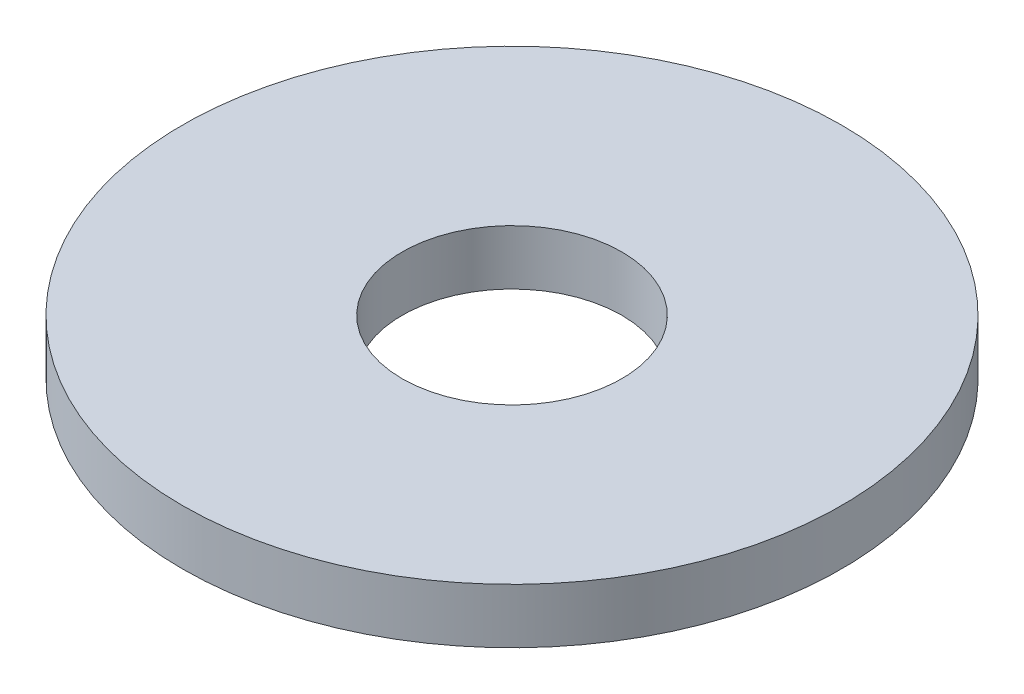
ISO-10303-21;
HEADER;
FILE_DESCRIPTION(('STEP AP214'),'2;1');
FILE_NAME('part.step','',(''),(''),'','','');
FILE_SCHEMA(('AUTOMOTIVE_DESIGN { 1 0 10303 214 1 1 1 1 }'));
ENDSEC;
DATA;
#1=APPLICATION_CONTEXT('core data for automotive mechanical design processes');
#2=APPLICATION_PROTOCOL_DEFINITION('international standard','automotive_design',2000,#1);
#3=PRODUCT_CONTEXT('',#1,'mechanical');
#4=PRODUCT('Part','Part','',(#3));
#5=PRODUCT_RELATED_PRODUCT_CATEGORY('part','',(#4));
#6=PRODUCT_DEFINITION_FORMATION('','',#4);
#7=PRODUCT_DEFINITION_CONTEXT('part definition',#1,'design');
#8=PRODUCT_DEFINITION('design','',#6,#7);
#9=PRODUCT_DEFINITION_SHAPE('','',#8);
#10=(LENGTH_UNIT() NAMED_UNIT(*) SI_UNIT(.MILLI.,.METRE.));
#11=(NAMED_UNIT(*) PLANE_ANGLE_UNIT() SI_UNIT($,.RADIAN.));
#12=(NAMED_UNIT(*) SI_UNIT($,.STERADIAN.) SOLID_ANGLE_UNIT());
#13=UNCERTAINTY_MEASURE_WITH_UNIT(LENGTH_MEASURE(1.E-05),#10,'distance_accuracy_value','');
#14=(GEOMETRIC_REPRESENTATION_CONTEXT(3) GLOBAL_UNCERTAINTY_ASSIGNED_CONTEXT((#13)) GLOBAL_UNIT_ASSIGNED_CONTEXT((#10,
#11,#12)) REPRESENTATION_CONTEXT('',''));
#15=CARTESIAN_POINT('',(0.,0.,0.));
#16=DIRECTION('',(0.,0.,1.));
#17=DIRECTION('',(1.,0.,0.));
#18=AXIS2_PLACEMENT_3D('',#15,#16,#17);
#19=CARTESIAN_POINT('',(0.,1.,0.));
#20=DIRECTION('',(0.,1.,0.));
#21=DIRECTION('',(0.,0.,1.));
#22=AXIS2_PLACEMENT_3D('',#19,#20,#21);
#23=PLANE('',#22);
#24=CARTESIAN_POINT('',(0.,1.,0.));
#25=DIRECTION('',(0.,1.,0.));
#26=DIRECTION('',(0.,0.,1.));
#27=AXIS2_PLACEMENT_3D('',#24,#25,#26);
#28=CIRCLE('',#27,6.);
#29=CARTESIAN_POINT('',(0.,1.,6.));
#30=VERTEX_POINT('',#29);
#31=EDGE_CURVE('E10',#30,#30,#28,.T.);
#32=ORIENTED_EDGE('',*,*,#31,.T.);
#33=EDGE_LOOP('',(#32));
#34=FACE_BOUND('',#33,.T.);
#35=CARTESIAN_POINT('',(0.,1.,0.));
#36=DIRECTION('',(0.,1.,0.));
#37=DIRECTION('',(0.,0.,1.));
#38=AXIS2_PLACEMENT_3D('',#35,#36,#37);
#39=CIRCLE('',#38,2.);
#40=CARTESIAN_POINT('',(0.,1.,2.));
#41=VERTEX_POINT('',#40);
#42=EDGE_CURVE('E44',#41,#41,#39,.T.);
#43=ORIENTED_EDGE('',*,*,#42,.F.);
#44=EDGE_LOOP('',(#43));
#45=FACE_BOUND('',#44,.T.);
#46=ADVANCED_FACE('F33',(#34,#45),#23,.T.);
#47=CARTESIAN_POINT('',(0.,0.,0.));
#48=DIRECTION('',(0.,1.,0.));
#49=DIRECTION('',(0.,0.,1.));
#50=AXIS2_PLACEMENT_3D('',#47,#48,#49);
#51=PLANE('',#50);
#52=CARTESIAN_POINT('',(0.,0.,0.));
#53=DIRECTION('',(0.,1.,0.));
#54=DIRECTION('',(0.,0.,1.));
#55=AXIS2_PLACEMENT_3D('',#52,#53,#54);
#56=CIRCLE('',#55,6.);
#57=CARTESIAN_POINT('',(0.,0.,6.));
#58=VERTEX_POINT('',#57);
#59=EDGE_CURVE('E37',#58,#58,#56,.T.);
#60=ORIENTED_EDGE('',*,*,#59,.F.);
#61=EDGE_LOOP('',(#60));
#62=FACE_BOUND('',#61,.T.);
#63=CARTESIAN_POINT('',(0.,0.,0.));
#64=DIRECTION('',(0.,1.,0.));
#65=DIRECTION('',(0.,0.,1.));
#66=AXIS2_PLACEMENT_3D('',#63,#64,#65);
#67=CIRCLE('',#66,2.);
#68=CARTESIAN_POINT('',(0.,0.,2.));
#69=VERTEX_POINT('',#68);
#70=EDGE_CURVE('E46',#69,#69,#67,.T.);
#71=ORIENTED_EDGE('',*,*,#70,.T.);
#72=EDGE_LOOP('',(#71));
#73=FACE_BOUND('',#72,.T.);
#74=ADVANCED_FACE('F56',(#62,#73),#51,.F.);
#75=CARTESIAN_POINT('',(0.,1.,0.));
#76=DIRECTION('',(0.,-1.,0.));
#77=DIRECTION('',(0.,0.,-1.));
#78=AXIS2_PLACEMENT_3D('',#75,#76,#77);
#79=CYLINDRICAL_SURFACE('',#78,6.);
#80=ORIENTED_EDGE('',*,*,#31,.F.);
#81=EDGE_LOOP('',(#80));
#82=FACE_BOUND('',#81,.T.);
#83=ORIENTED_EDGE('',*,*,#59,.T.);
#84=EDGE_LOOP('',(#83));
#85=FACE_BOUND('',#84,.T.);
#86=ADVANCED_FACE('F35',(#82,#85),#79,.T.);
#87=CARTESIAN_POINT('',(0.,1.,0.));
#88=DIRECTION('',(0.,-1.,0.));
#89=DIRECTION('',(0.,0.,-1.));
#90=AXIS2_PLACEMENT_3D('',#87,#88,#89);
#91=CYLINDRICAL_SURFACE('',#90,2.);
#92=ORIENTED_EDGE('',*,*,#42,.T.);
#93=EDGE_LOOP('',(#92));
#94=FACE_BOUND('',#93,.T.);
#95=ORIENTED_EDGE('',*,*,#70,.F.);
#96=EDGE_LOOP('',(#95));
#97=FACE_BOUND('',#96,.T.);
#98=ADVANCED_FACE('F52',(#94,#97),#91,.F.);
#99=CLOSED_SHELL('',(#46,#74,#86,#98));
#100=MANIFOLD_SOLID_BREP('B2',#99);
#101=ADVANCED_BREP_SHAPE_REPRESENTATION('',(#18,#100),#14);
#102=SHAPE_DEFINITION_REPRESENTATION(#9,#101);
ENDSEC;
END-ISO-10303-21;
